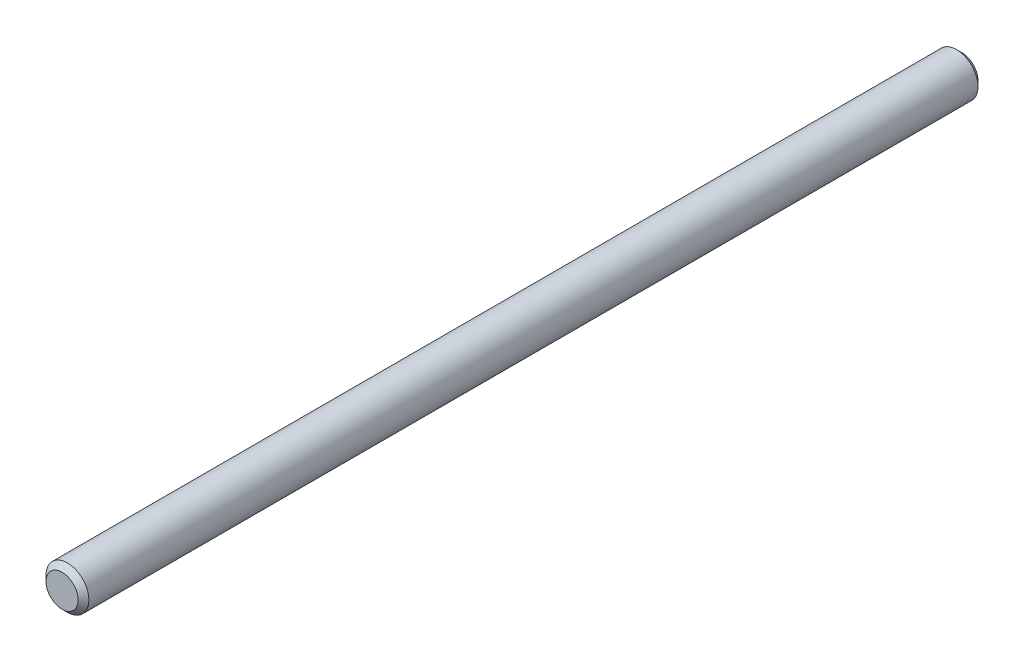
ISO-10303-21;
HEADER;
FILE_DESCRIPTION(('STEP AP214'),'2;1');
FILE_NAME('part.step','',(''),(''),'','','');
FILE_SCHEMA(('AUTOMOTIVE_DESIGN { 1 0 10303 214 1 1 1 1 }'));
ENDSEC;
DATA;
#1=APPLICATION_CONTEXT('core data for automotive mechanical design processes');
#2=APPLICATION_PROTOCOL_DEFINITION('international standard','automotive_design',2000,#1);
#3=PRODUCT_CONTEXT('',#1,'mechanical');
#4=PRODUCT('Part','Part','',(#3));
#5=PRODUCT_RELATED_PRODUCT_CATEGORY('part','',(#4));
#6=PRODUCT_DEFINITION_FORMATION('','',#4);
#7=PRODUCT_DEFINITION_CONTEXT('part definition',#1,'design');
#8=PRODUCT_DEFINITION('design','',#6,#7);
#9=PRODUCT_DEFINITION_SHAPE('','',#8);
#10=(LENGTH_UNIT() NAMED_UNIT(*) SI_UNIT(.MILLI.,.METRE.));
#11=(NAMED_UNIT(*) PLANE_ANGLE_UNIT() SI_UNIT($,.RADIAN.));
#12=(NAMED_UNIT(*) SI_UNIT($,.STERADIAN.) SOLID_ANGLE_UNIT());
#13=UNCERTAINTY_MEASURE_WITH_UNIT(LENGTH_MEASURE(1.E-05),#10,'distance_accuracy_value','');
#14=(GEOMETRIC_REPRESENTATION_CONTEXT(3) GLOBAL_UNCERTAINTY_ASSIGNED_CONTEXT((#13)) GLOBAL_UNIT_ASSIGNED_CONTEXT((#10,
#11,#12)) REPRESENTATION_CONTEXT('',''));
#15=CARTESIAN_POINT('',(0.,0.,0.));
#16=DIRECTION('',(0.,0.,1.));
#17=DIRECTION('',(1.,0.,0.));
#18=AXIS2_PLACEMENT_3D('',#15,#16,#17);
#19=CARTESIAN_POINT('',(0.,0.,42.));
#20=DIRECTION('',(0.,0.,-1.));
#21=DIRECTION('',(-1.,0.,0.));
#22=AXIS2_PLACEMENT_3D('',#19,#20,#21);
#23=CYLINDRICAL_SURFACE('',#22,2.);
#24=CARTESIAN_POINT('',(0.,0.,41.5));
#25=DIRECTION('',(0.,0.,1.));
#26=DIRECTION('',(1.,0.,0.));
#27=AXIS2_PLACEMENT_3D('',#24,#25,#26);
#28=CIRCLE('',#27,2.);
#29=CARTESIAN_POINT('',(2.,0.,41.5));
#30=VERTEX_POINT('',#29);
#31=EDGE_CURVE('E57',#30,#30,#28,.F.);
#32=ORIENTED_EDGE('',*,*,#31,.T.);
#33=EDGE_LOOP('',(#32));
#34=FACE_BOUND('',#33,.T.);
#35=CARTESIAN_POINT('',(0.,0.,-41.4999999999999));
#36=DIRECTION('',(0.,0.,1.));
#37=DIRECTION('',(1.,0.,0.));
#38=AXIS2_PLACEMENT_3D('',#35,#36,#37);
#39=CIRCLE('',#38,2.);
#40=CARTESIAN_POINT('',(2.,0.,-41.4999999999999));
#41=VERTEX_POINT('',#40);
#42=EDGE_CURVE('E61',#41,#41,#39,.T.);
#43=ORIENTED_EDGE('',*,*,#42,.T.);
#44=EDGE_LOOP('',(#43));
#45=FACE_BOUND('',#44,.T.);
#46=ADVANCED_FACE('F49',(#34,#45),#23,.T.);
#47=CARTESIAN_POINT('',(0.,0.,42.));
#48=DIRECTION('',(0.,0.,1.));
#49=DIRECTION('',(1.,0.,0.));
#50=AXIS2_PLACEMENT_3D('',#47,#48,#49);
#51=PLANE('',#50);
#52=CARTESIAN_POINT('',(0.,0.,42.));
#53=DIRECTION('',(0.,0.,1.));
#54=DIRECTION('',(1.,0.,0.));
#55=AXIS2_PLACEMENT_3D('',#52,#53,#54);
#56=CIRCLE('',#55,1.50000000000004);
#57=CARTESIAN_POINT('',(1.50000000000004,0.,42.));
#58=VERTEX_POINT('',#57);
#59=EDGE_CURVE('E65',#58,#58,#56,.T.);
#60=ORIENTED_EDGE('',*,*,#59,.T.);
#61=EDGE_LOOP('',(#60));
#62=FACE_BOUND('',#61,.T.);
#63=ADVANCED_FACE('F71',(#62),#51,.T.);
#64=CARTESIAN_POINT('',(0.,0.,-42.));
#65=DIRECTION('',(0.,0.,1.));
#66=DIRECTION('',(1.,0.,0.));
#67=AXIS2_PLACEMENT_3D('',#64,#65,#66);
#68=PLANE('',#67);
#69=CARTESIAN_POINT('',(0.,0.,-42.));
#70=DIRECTION('',(0.,0.,1.));
#71=DIRECTION('',(1.,0.,0.));
#72=AXIS2_PLACEMENT_3D('',#69,#70,#71);
#73=CIRCLE('',#72,1.49999999999994);
#74=CARTESIAN_POINT('',(1.49999999999994,0.,-42.));
#75=VERTEX_POINT('',#74);
#76=EDGE_CURVE('E10',#75,#75,#73,.F.);
#77=ORIENTED_EDGE('',*,*,#76,.T.);
#78=EDGE_LOOP('',(#77));
#79=FACE_BOUND('',#78,.T.);
#80=ADVANCED_FACE('F75',(#79),#68,.F.);
#81=CARTESIAN_POINT('',(0.,0.,42.));
#82=DIRECTION('',(0.,0.,-1.));
#83=DIRECTION('',(-1.,0.,0.));
#84=AXIS2_PLACEMENT_3D('',#81,#82,#83);
#85=CONICAL_SURFACE('',#84,1.50000000000004,0.785398163397447);
#86=ORIENTED_EDGE('',*,*,#31,.F.);
#87=EDGE_LOOP('',(#86));
#88=FACE_BOUND('',#87,.T.);
#89=ORIENTED_EDGE('',*,*,#59,.F.);
#90=EDGE_LOOP('',(#89));
#91=FACE_BOUND('',#90,.T.);
#92=ADVANCED_FACE('F73',(#88,#91),#85,.T.);
#93=CARTESIAN_POINT('',(0.,0.,-41.4999999999999));
#94=DIRECTION('',(0.,0.,1.));
#95=DIRECTION('',(1.,0.,0.));
#96=AXIS2_PLACEMENT_3D('',#93,#94,#95);
#97=CONICAL_SURFACE('',#96,2.,0.78539816339744);
#98=ORIENTED_EDGE('',*,*,#76,.F.);
#99=EDGE_LOOP('',(#98));
#100=FACE_BOUND('',#99,.T.);
#101=ORIENTED_EDGE('',*,*,#42,.F.);
#102=EDGE_LOOP('',(#101));
#103=FACE_BOUND('',#102,.T.);
#104=ADVANCED_FACE('F52',(#100,#103),#97,.T.);
#105=CLOSED_SHELL('',(#46,#63,#80,#92,#104));
#106=MANIFOLD_SOLID_BREP('B2',#105);
#107=ADVANCED_BREP_SHAPE_REPRESENTATION('',(#18,#106),#14);
#108=SHAPE_DEFINITION_REPRESENTATION(#9,#107);
ENDSEC;
END-ISO-10303-21;
